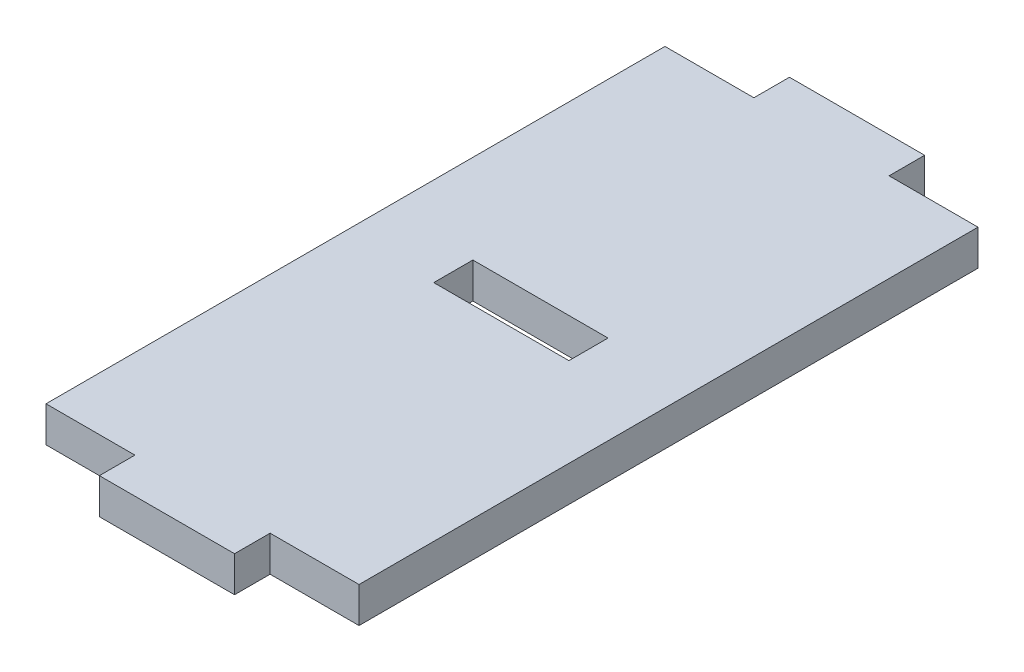
ISO-10303-21;
HEADER;
FILE_DESCRIPTION(('STEP AP214'),'2;1');
FILE_NAME('part.step','',(''),(''),'','','');
FILE_SCHEMA(('AUTOMOTIVE_DESIGN { 1 0 10303 214 1 1 1 1 }'));
ENDSEC;
DATA;
#1=APPLICATION_CONTEXT('core data for automotive mechanical design processes');
#2=APPLICATION_PROTOCOL_DEFINITION('international standard','automotive_design',2000,#1);
#3=PRODUCT_CONTEXT('',#1,'mechanical');
#4=PRODUCT('Part','Part','',(#3));
#5=PRODUCT_RELATED_PRODUCT_CATEGORY('part','',(#4));
#6=PRODUCT_DEFINITION_FORMATION('','',#4);
#7=PRODUCT_DEFINITION_CONTEXT('part definition',#1,'design');
#8=PRODUCT_DEFINITION('design','',#6,#7);
#9=PRODUCT_DEFINITION_SHAPE('','',#8);
#10=(LENGTH_UNIT() NAMED_UNIT(*) SI_UNIT(.MILLI.,.METRE.));
#11=(NAMED_UNIT(*) PLANE_ANGLE_UNIT() SI_UNIT($,.RADIAN.));
#12=(NAMED_UNIT(*) SI_UNIT($,.STERADIAN.) SOLID_ANGLE_UNIT());
#13=UNCERTAINTY_MEASURE_WITH_UNIT(LENGTH_MEASURE(1.E-05),#10,'distance_accuracy_value','');
#14=(GEOMETRIC_REPRESENTATION_CONTEXT(3) GLOBAL_UNCERTAINTY_ASSIGNED_CONTEXT((#13)) GLOBAL_UNIT_ASSIGNED_CONTEXT((#10,
#11,#12)) REPRESENTATION_CONTEXT('',''));
#15=CARTESIAN_POINT('',(0.,0.,0.));
#16=DIRECTION('',(0.,0.,1.));
#17=DIRECTION('',(1.,0.,0.));
#18=AXIS2_PLACEMENT_3D('',#15,#16,#17);
#19=CARTESIAN_POINT('',(0.,2.,-19.));
#20=DIRECTION('',(0.,0.,-1.));
#21=DIRECTION('',(-1.,0.,0.));
#22=AXIS2_PLACEMENT_3D('',#19,#20,#21);
#23=PLANE('',#22);
#24=DIRECTION('',(1.,0.,0.));
#25=VECTOR('',#24,1.);
#26=CARTESIAN_POINT('',(0.,0.,-19.));
#27=LINE('',#26,#25);
#28=CARTESIAN_POINT('',(5.,0.,-19.));
#29=VERTEX_POINT('',#28);
#30=CARTESIAN_POINT('',(12.6,0.,-19.));
#31=VERTEX_POINT('',#30);
#32=EDGE_CURVE('E212',#29,#31,#27,.T.);
#33=ORIENTED_EDGE('',*,*,#32,.T.);
#34=DIRECTION('',(0.,-1.,0.));
#35=VECTOR('',#34,1.);
#36=CARTESIAN_POINT('',(12.6,2.,-19.));
#37=LINE('',#36,#35);
#38=CARTESIAN_POINT('',(12.6,2.,-19.));
#39=VERTEX_POINT('',#38);
#40=EDGE_CURVE('E11',#39,#31,#37,.T.);
#41=ORIENTED_EDGE('',*,*,#40,.F.);
#42=DIRECTION('',(1.,0.,0.));
#43=VECTOR('',#42,1.);
#44=CARTESIAN_POINT('',(0.,2.,-19.));
#45=LINE('',#44,#43);
#46=CARTESIAN_POINT('',(5.,2.,-19.));
#47=VERTEX_POINT('',#46);
#48=EDGE_CURVE('E164',#47,#39,#45,.T.);
#49=ORIENTED_EDGE('',*,*,#48,.F.);
#50=DIRECTION('',(0.,-1.,0.));
#51=VECTOR('',#50,1.);
#52=CARTESIAN_POINT('',(5.,2.,-19.));
#53=LINE('',#52,#51);
#54=EDGE_CURVE('E55',#47,#29,#53,.T.);
#55=ORIENTED_EDGE('',*,*,#54,.T.);
#56=EDGE_LOOP('',(#33,#41,#49,#55));
#57=FACE_BOUND('',#56,.T.);
#58=ADVANCED_FACE('F36',(#57),#23,.F.);
#59=CARTESIAN_POINT('',(12.6,2.,0.));
#60=DIRECTION('',(1.,0.,0.));
#61=DIRECTION('',(0.,0.,-1.));
#62=AXIS2_PLACEMENT_3D('',#59,#60,#61);
#63=PLANE('',#62);
#64=DIRECTION('',(0.,0.,1.));
#65=VECTOR('',#64,1.);
#66=CARTESIAN_POINT('',(12.6,0.,0.));
#67=LINE('',#66,#65);
#68=CARTESIAN_POINT('',(12.6,0.,-16.8));
#69=VERTEX_POINT('',#68);
#70=EDGE_CURVE('E170',#31,#69,#67,.T.);
#71=ORIENTED_EDGE('',*,*,#70,.T.);
#72=DIRECTION('',(0.,-1.,0.));
#73=VECTOR('',#72,1.);
#74=CARTESIAN_POINT('',(12.6,2.,-16.8));
#75=LINE('',#74,#73);
#76=CARTESIAN_POINT('',(12.6,2.,-16.8));
#77=VERTEX_POINT('',#76);
#78=EDGE_CURVE('E46',#77,#69,#75,.T.);
#79=ORIENTED_EDGE('',*,*,#78,.F.);
#80=DIRECTION('',(0.,0.,1.));
#81=VECTOR('',#80,1.);
#82=CARTESIAN_POINT('',(12.6,2.,0.));
#83=LINE('',#82,#81);
#84=EDGE_CURVE('E158',#39,#77,#83,.T.);
#85=ORIENTED_EDGE('',*,*,#84,.F.);
#86=ORIENTED_EDGE('',*,*,#40,.T.);
#87=EDGE_LOOP('',(#71,#79,#85,#86));
#88=FACE_BOUND('',#87,.T.);
#89=ADVANCED_FACE('F169',(#88),#63,.F.);
#90=CARTESIAN_POINT('',(0.,2.,-16.8));
#91=DIRECTION('',(0.,0.,-1.));
#92=DIRECTION('',(-1.,0.,0.));
#93=AXIS2_PLACEMENT_3D('',#90,#91,#92);
#94=PLANE('',#93);
#95=DIRECTION('',(1.,0.,0.));
#96=VECTOR('',#95,1.);
#97=CARTESIAN_POINT('',(0.,0.,-16.8));
#98=LINE('',#97,#96);
#99=CARTESIAN_POINT('',(5.,0.,-16.8));
#100=VERTEX_POINT('',#99);
#101=EDGE_CURVE('E215',#100,#69,#98,.T.);
#102=ORIENTED_EDGE('',*,*,#101,.F.);
#103=DIRECTION('',(0.,-1.,0.));
#104=VECTOR('',#103,1.);
#105=CARTESIAN_POINT('',(5.,2.,-16.8));
#106=LINE('',#105,#104);
#107=CARTESIAN_POINT('',(5.,2.,-16.8));
#108=VERTEX_POINT('',#107);
#109=EDGE_CURVE('E105',#108,#100,#106,.T.);
#110=ORIENTED_EDGE('',*,*,#109,.F.);
#111=DIRECTION('',(1.,0.,0.));
#112=VECTOR('',#111,1.);
#113=CARTESIAN_POINT('',(0.,2.,-16.8));
#114=LINE('',#113,#112);
#115=EDGE_CURVE('E163',#108,#77,#114,.T.);
#116=ORIENTED_EDGE('',*,*,#115,.T.);
#117=ORIENTED_EDGE('',*,*,#78,.T.);
#118=EDGE_LOOP('',(#102,#110,#116,#117));
#119=FACE_BOUND('',#118,.T.);
#120=ADVANCED_FACE('F174',(#119),#94,.T.);
#121=CARTESIAN_POINT('',(0.,2.,0.));
#122=DIRECTION('',(0.,0.,-1.));
#123=DIRECTION('',(-1.,0.,0.));
#124=AXIS2_PLACEMENT_3D('',#121,#122,#123);
#125=PLANE('',#124);
#126=DIRECTION('',(1.,0.,0.));
#127=VECTOR('',#126,1.);
#128=CARTESIAN_POINT('',(0.,0.,0.));
#129=LINE('',#128,#127);
#130=CARTESIAN_POINT('',(0.,0.,0.));
#131=VERTEX_POINT('',#130);
#132=CARTESIAN_POINT('',(5.,0.,0.));
#133=VERTEX_POINT('',#132);
#134=EDGE_CURVE('E181',#131,#133,#129,.T.);
#135=ORIENTED_EDGE('',*,*,#134,.T.);
#136=DIRECTION('',(0.,-1.,0.));
#137=VECTOR('',#136,1.);
#138=CARTESIAN_POINT('',(5.,2.,0.));
#139=LINE('',#138,#137);
#140=CARTESIAN_POINT('',(5.,2.,0.));
#141=VERTEX_POINT('',#140);
#142=EDGE_CURVE('E40',#141,#133,#139,.T.);
#143=ORIENTED_EDGE('',*,*,#142,.F.);
#144=DIRECTION('',(1.,0.,0.));
#145=VECTOR('',#144,1.);
#146=CARTESIAN_POINT('',(0.,2.,0.));
#147=LINE('',#146,#145);
#148=CARTESIAN_POINT('',(0.,2.,0.));
#149=VERTEX_POINT('',#148);
#150=EDGE_CURVE('E220',#149,#141,#147,.T.);
#151=ORIENTED_EDGE('',*,*,#150,.F.);
#152=DIRECTION('',(0.,-1.,0.));
#153=VECTOR('',#152,1.);
#154=CARTESIAN_POINT('',(0.,2.,0.));
#155=LINE('',#154,#153);
#156=EDGE_CURVE('E177',#149,#131,#155,.T.);
#157=ORIENTED_EDGE('',*,*,#156,.T.);
#158=EDGE_LOOP('',(#135,#143,#151,#157));
#159=FACE_BOUND('',#158,.T.);
#160=ADVANCED_FACE('F251',(#159),#125,.F.);
#161=CARTESIAN_POINT('',(5.,2.,0.));
#162=DIRECTION('',(1.,0.,0.));
#163=DIRECTION('',(0.,0.,-1.));
#164=AXIS2_PLACEMENT_3D('',#161,#162,#163);
#165=PLANE('',#164);
#166=DIRECTION('',(0.,0.,1.));
#167=VECTOR('',#166,1.);
#168=CARTESIAN_POINT('',(5.,0.,0.));
#169=LINE('',#168,#167);
#170=CARTESIAN_POINT('',(5.,0.,2.));
#171=VERTEX_POINT('',#170);
#172=EDGE_CURVE('E184',#133,#171,#169,.T.);
#173=ORIENTED_EDGE('',*,*,#172,.T.);
#174=DIRECTION('',(0.,-1.,0.));
#175=VECTOR('',#174,1.);
#176=CARTESIAN_POINT('',(5.,2.,2.));
#177=LINE('',#176,#175);
#178=CARTESIAN_POINT('',(5.,2.,2.));
#179=VERTEX_POINT('',#178);
#180=EDGE_CURVE('E242',#179,#171,#177,.T.);
#181=ORIENTED_EDGE('',*,*,#180,.F.);
#182=DIRECTION('',(0.,0.,1.));
#183=VECTOR('',#182,1.);
#184=CARTESIAN_POINT('',(5.,2.,0.));
#185=LINE('',#184,#183);
#186=EDGE_CURVE('E118',#141,#179,#185,.T.);
#187=ORIENTED_EDGE('',*,*,#186,.F.);
#188=ORIENTED_EDGE('',*,*,#142,.T.);
#189=EDGE_LOOP('',(#173,#181,#187,#188));
#190=FACE_BOUND('',#189,.T.);
#191=ADVANCED_FACE('F38',(#190),#165,.F.);
#192=CARTESIAN_POINT('',(0.,2.,2.));
#193=DIRECTION('',(0.,0.,-1.));
#194=DIRECTION('',(-1.,0.,0.));
#195=AXIS2_PLACEMENT_3D('',#192,#193,#194);
#196=PLANE('',#195);
#197=DIRECTION('',(1.,0.,0.));
#198=VECTOR('',#197,1.);
#199=CARTESIAN_POINT('',(0.,0.,2.));
#200=LINE('',#199,#198);
#201=CARTESIAN_POINT('',(12.6,0.,2.));
#202=VERTEX_POINT('',#201);
#203=EDGE_CURVE('E187',#171,#202,#200,.T.);
#204=ORIENTED_EDGE('',*,*,#203,.T.);
#205=DIRECTION('',(0.,-1.,0.));
#206=VECTOR('',#205,1.);
#207=CARTESIAN_POINT('',(12.6,2.,2.));
#208=LINE('',#207,#206);
#209=CARTESIAN_POINT('',(12.6,2.,2.));
#210=VERTEX_POINT('',#209);
#211=EDGE_CURVE('E241',#210,#202,#208,.T.);
#212=ORIENTED_EDGE('',*,*,#211,.F.);
#213=DIRECTION('',(1.,0.,0.));
#214=VECTOR('',#213,1.);
#215=CARTESIAN_POINT('',(0.,2.,2.));
#216=LINE('',#215,#214);
#217=EDGE_CURVE('E355',#179,#210,#216,.T.);
#218=ORIENTED_EDGE('',*,*,#217,.F.);
#219=ORIENTED_EDGE('',*,*,#180,.T.);
#220=EDGE_LOOP('',(#204,#212,#218,#219));
#221=FACE_BOUND('',#220,.T.);
#222=ADVANCED_FACE('F307',(#221),#196,.F.);
#223=CARTESIAN_POINT('',(12.6,2.,0.));
#224=DIRECTION('',(1.,0.,0.));
#225=DIRECTION('',(0.,0.,-1.));
#226=AXIS2_PLACEMENT_3D('',#223,#224,#225);
#227=PLANE('',#226);
#228=DIRECTION('',(0.,0.,1.));
#229=VECTOR('',#228,1.);
#230=CARTESIAN_POINT('',(12.6,0.,0.));
#231=LINE('',#230,#229);
#232=CARTESIAN_POINT('',(12.6,0.,0.));
#233=VERTEX_POINT('',#232);
#234=EDGE_CURVE('E190',#233,#202,#231,.T.);
#235=ORIENTED_EDGE('',*,*,#234,.F.);
#236=DIRECTION('',(0.,-1.,0.));
#237=VECTOR('',#236,1.);
#238=CARTESIAN_POINT('',(12.6,2.,0.));
#239=LINE('',#238,#237);
#240=CARTESIAN_POINT('',(12.6,2.,0.));
#241=VERTEX_POINT('',#240);
#242=EDGE_CURVE('E239',#241,#233,#239,.T.);
#243=ORIENTED_EDGE('',*,*,#242,.F.);
#244=DIRECTION('',(0.,0.,1.));
#245=VECTOR('',#244,1.);
#246=CARTESIAN_POINT('',(12.6,2.,0.));
#247=LINE('',#246,#245);
#248=EDGE_CURVE('E306',#241,#210,#247,.T.);
#249=ORIENTED_EDGE('',*,*,#248,.T.);
#250=ORIENTED_EDGE('',*,*,#211,.T.);
#251=EDGE_LOOP('',(#235,#243,#249,#250));
#252=FACE_BOUND('',#251,.T.);
#253=ADVANCED_FACE('F303',(#252),#227,.T.);
#254=CARTESIAN_POINT('',(17.6,0.,0.));
#255=VERTEX_POINT('',#254);
#256=EDGE_CURVE('E185',#233,#255,#129,.T.);
#257=ORIENTED_EDGE('',*,*,#256,.T.);
#258=DIRECTION('',(0.,-1.,0.));
#259=VECTOR('',#258,1.);
#260=CARTESIAN_POINT('',(17.6,2.,0.));
#261=LINE('',#260,#259);
#262=CARTESIAN_POINT('',(17.6,2.,0.));
#263=VERTEX_POINT('',#262);
#264=EDGE_CURVE('E236',#263,#255,#261,.T.);
#265=ORIENTED_EDGE('',*,*,#264,.F.);
#266=EDGE_CURVE('E299',#241,#263,#147,.T.);
#267=ORIENTED_EDGE('',*,*,#266,.F.);
#268=ORIENTED_EDGE('',*,*,#242,.T.);
#269=EDGE_LOOP('',(#257,#265,#267,#268));
#270=FACE_BOUND('',#269,.T.);
#271=ADVANCED_FACE('F298',(#270),#125,.F.);
#272=CARTESIAN_POINT('',(17.6,2.,0.));
#273=DIRECTION('',(-1.,0.,0.));
#274=DIRECTION('',(0.,0.,1.));
#275=AXIS2_PLACEMENT_3D('',#272,#273,#274);
#276=PLANE('',#275);
#277=DIRECTION('',(0.,0.,-1.));
#278=VECTOR('',#277,1.);
#279=CARTESIAN_POINT('',(17.6,0.,0.));
#280=LINE('',#279,#278);
#281=CARTESIAN_POINT('',(17.6,0.,-34.8));
#282=VERTEX_POINT('',#281);
#283=EDGE_CURVE('E193',#255,#282,#280,.T.);
#284=ORIENTED_EDGE('',*,*,#283,.T.);
#285=DIRECTION('',(0.,-1.,0.));
#286=VECTOR('',#285,1.);
#287=CARTESIAN_POINT('',(17.6,2.,-34.8));
#288=LINE('',#287,#286);
#289=CARTESIAN_POINT('',(17.6,2.,-34.8));
#290=VERTEX_POINT('',#289);
#291=EDGE_CURVE('E234',#290,#282,#288,.T.);
#292=ORIENTED_EDGE('',*,*,#291,.F.);
#293=DIRECTION('',(0.,0.,-1.));
#294=VECTOR('',#293,1.);
#295=CARTESIAN_POINT('',(17.6,2.,0.));
#296=LINE('',#295,#294);
#297=EDGE_CURVE('E295',#263,#290,#296,.T.);
#298=ORIENTED_EDGE('',*,*,#297,.F.);
#299=ORIENTED_EDGE('',*,*,#264,.T.);
#300=EDGE_LOOP('',(#284,#292,#298,#299));
#301=FACE_BOUND('',#300,.T.);
#302=ADVANCED_FACE('F293',(#301),#276,.F.);
#303=CARTESIAN_POINT('',(0.,2.,-34.8));
#304=DIRECTION('',(0.,0.,-1.));
#305=DIRECTION('',(-1.,0.,0.));
#306=AXIS2_PLACEMENT_3D('',#303,#304,#305);
#307=PLANE('',#306);
#308=DIRECTION('',(1.,0.,0.));
#309=VECTOR('',#308,1.);
#310=CARTESIAN_POINT('',(0.,0.,-34.8));
#311=LINE('',#310,#309);
#312=CARTESIAN_POINT('',(12.6,0.,-34.8));
#313=VERTEX_POINT('',#312);
#314=EDGE_CURVE('E196',#313,#282,#311,.T.);
#315=ORIENTED_EDGE('',*,*,#314,.F.);
#316=DIRECTION('',(0.,-1.,0.));
#317=VECTOR('',#316,1.);
#318=CARTESIAN_POINT('',(12.6,2.,-34.8));
#319=LINE('',#318,#317);
#320=CARTESIAN_POINT('',(12.6,2.,-34.8));
#321=VERTEX_POINT('',#320);
#322=EDGE_CURVE('E232',#321,#313,#319,.T.);
#323=ORIENTED_EDGE('',*,*,#322,.F.);
#324=DIRECTION('',(1.,0.,0.));
#325=VECTOR('',#324,1.);
#326=CARTESIAN_POINT('',(0.,2.,-34.8));
#327=LINE('',#326,#325);
#328=EDGE_CURVE('E290',#321,#290,#327,.T.);
#329=ORIENTED_EDGE('',*,*,#328,.T.);
#330=ORIENTED_EDGE('',*,*,#291,.T.);
#331=EDGE_LOOP('',(#315,#323,#329,#330));
#332=FACE_BOUND('',#331,.T.);
#333=ADVANCED_FACE('F286',(#332),#307,.T.);
#334=CARTESIAN_POINT('',(12.6,2.,0.));
#335=DIRECTION('',(1.,0.,0.));
#336=DIRECTION('',(0.,0.,-1.));
#337=AXIS2_PLACEMENT_3D('',#334,#335,#336);
#338=PLANE('',#337);
#339=DIRECTION('',(0.,0.,1.));
#340=VECTOR('',#339,1.);
#341=CARTESIAN_POINT('',(12.6,0.,0.));
#342=LINE('',#341,#340);
#343=CARTESIAN_POINT('',(12.6,0.,-36.8));
#344=VERTEX_POINT('',#343);
#345=EDGE_CURVE('E199',#344,#313,#342,.T.);
#346=ORIENTED_EDGE('',*,*,#345,.F.);
#347=DIRECTION('',(0.,-1.,0.));
#348=VECTOR('',#347,1.);
#349=CARTESIAN_POINT('',(12.6,2.,-36.8));
#350=LINE('',#349,#348);
#351=CARTESIAN_POINT('',(12.6,2.,-36.8));
#352=VERTEX_POINT('',#351);
#353=EDGE_CURVE('E230',#352,#344,#350,.T.);
#354=ORIENTED_EDGE('',*,*,#353,.F.);
#355=DIRECTION('',(0.,0.,1.));
#356=VECTOR('',#355,1.);
#357=CARTESIAN_POINT('',(12.6,2.,0.));
#358=LINE('',#357,#356);
#359=EDGE_CURVE('E362',#352,#321,#358,.T.);
#360=ORIENTED_EDGE('',*,*,#359,.T.);
#361=ORIENTED_EDGE('',*,*,#322,.T.);
#362=EDGE_LOOP('',(#346,#354,#360,#361));
#363=FACE_BOUND('',#362,.T.);
#364=ADVANCED_FACE('F281',(#363),#338,.T.);
#365=CARTESIAN_POINT('',(0.,2.,-36.8));
#366=DIRECTION('',(0.,0.,-1.));
#367=DIRECTION('',(-1.,0.,0.));
#368=AXIS2_PLACEMENT_3D('',#365,#366,#367);
#369=PLANE('',#368);
#370=DIRECTION('',(1.,0.,0.));
#371=VECTOR('',#370,1.);
#372=CARTESIAN_POINT('',(0.,0.,-36.8));
#373=LINE('',#372,#371);
#374=CARTESIAN_POINT('',(5.,0.,-36.8));
#375=VERTEX_POINT('',#374);
#376=EDGE_CURVE('E203',#375,#344,#373,.T.);
#377=ORIENTED_EDGE('',*,*,#376,.F.);
#378=DIRECTION('',(0.,-1.,0.));
#379=VECTOR('',#378,1.);
#380=CARTESIAN_POINT('',(5.,2.,-36.8));
#381=LINE('',#380,#379);
#382=CARTESIAN_POINT('',(5.,2.,-36.8));
#383=VERTEX_POINT('',#382);
#384=EDGE_CURVE('E228',#383,#375,#381,.T.);
#385=ORIENTED_EDGE('',*,*,#384,.F.);
#386=DIRECTION('',(1.,0.,0.));
#387=VECTOR('',#386,1.);
#388=CARTESIAN_POINT('',(0.,2.,-36.8));
#389=LINE('',#388,#387);
#390=EDGE_CURVE('E277',#383,#352,#389,.T.);
#391=ORIENTED_EDGE('',*,*,#390,.T.);
#392=ORIENTED_EDGE('',*,*,#353,.T.);
#393=EDGE_LOOP('',(#377,#385,#391,#392));
#394=FACE_BOUND('',#393,.T.);
#395=ADVANCED_FACE('F272',(#394),#369,.T.);
#396=CARTESIAN_POINT('',(5.,2.,0.));
#397=DIRECTION('',(1.,0.,0.));
#398=DIRECTION('',(0.,0.,-1.));
#399=AXIS2_PLACEMENT_3D('',#396,#397,#398);
#400=PLANE('',#399);
#401=DIRECTION('',(0.,0.,1.));
#402=VECTOR('',#401,1.);
#403=CARTESIAN_POINT('',(5.,0.,0.));
#404=LINE('',#403,#402);
#405=CARTESIAN_POINT('',(5.,0.,-34.8));
#406=VERTEX_POINT('',#405);
#407=EDGE_CURVE('E206',#375,#406,#404,.T.);
#408=ORIENTED_EDGE('',*,*,#407,.T.);
#409=DIRECTION('',(0.,-1.,0.));
#410=VECTOR('',#409,1.);
#411=CARTESIAN_POINT('',(5.,2.,-34.8));
#412=LINE('',#411,#410);
#413=CARTESIAN_POINT('',(5.,2.,-34.8));
#414=VERTEX_POINT('',#413);
#415=EDGE_CURVE('E226',#414,#406,#412,.T.);
#416=ORIENTED_EDGE('',*,*,#415,.F.);
#417=DIRECTION('',(0.,0.,1.));
#418=VECTOR('',#417,1.);
#419=CARTESIAN_POINT('',(5.,2.,0.));
#420=LINE('',#419,#418);
#421=EDGE_CURVE('E366',#383,#414,#420,.T.);
#422=ORIENTED_EDGE('',*,*,#421,.F.);
#423=ORIENTED_EDGE('',*,*,#384,.T.);
#424=EDGE_LOOP('',(#408,#416,#422,#423));
#425=FACE_BOUND('',#424,.T.);
#426=ADVANCED_FACE('F327',(#425),#400,.F.);
#427=CARTESIAN_POINT('',(0.,0.,-34.8));
#428=VERTEX_POINT('',#427);
#429=EDGE_CURVE('E200',#428,#406,#311,.T.);
#430=ORIENTED_EDGE('',*,*,#429,.F.);
#431=DIRECTION('',(0.,-1.,0.));
#432=VECTOR('',#431,1.);
#433=CARTESIAN_POINT('',(0.,2.,-34.8));
#434=LINE('',#433,#432);
#435=CARTESIAN_POINT('',(0.,2.,-34.8));
#436=VERTEX_POINT('',#435);
#437=EDGE_CURVE('E224',#436,#428,#434,.T.);
#438=ORIENTED_EDGE('',*,*,#437,.F.);
#439=EDGE_CURVE('E363',#436,#414,#327,.T.);
#440=ORIENTED_EDGE('',*,*,#439,.T.);
#441=ORIENTED_EDGE('',*,*,#415,.T.);
#442=EDGE_LOOP('',(#430,#438,#440,#441));
#443=FACE_BOUND('',#442,.T.);
#444=ADVANCED_FACE('F266',(#443),#307,.T.);
#445=CARTESIAN_POINT('',(0.,2.,0.));
#446=DIRECTION('',(-1.,0.,0.));
#447=DIRECTION('',(0.,0.,1.));
#448=AXIS2_PLACEMENT_3D('',#445,#446,#447);
#449=PLANE('',#448);
#450=DIRECTION('',(0.,0.,-1.));
#451=VECTOR('',#450,1.);
#452=CARTESIAN_POINT('',(0.,0.,0.));
#453=LINE('',#452,#451);
#454=EDGE_CURVE('E209',#131,#428,#453,.T.);
#455=ORIENTED_EDGE('',*,*,#454,.F.);
#456=ORIENTED_EDGE('',*,*,#156,.F.);
#457=DIRECTION('',(0.,0.,-1.));
#458=VECTOR('',#457,1.);
#459=CARTESIAN_POINT('',(0.,2.,0.));
#460=LINE('',#459,#458);
#461=EDGE_CURVE('E262',#149,#436,#460,.T.);
#462=ORIENTED_EDGE('',*,*,#461,.T.);
#463=ORIENTED_EDGE('',*,*,#437,.T.);
#464=EDGE_LOOP('',(#455,#456,#462,#463));
#465=FACE_BOUND('',#464,.T.);
#466=ADVANCED_FACE('F258',(#465),#449,.T.);
#467=CARTESIAN_POINT('',(5.,2.,0.));
#468=DIRECTION('',(1.,0.,0.));
#469=DIRECTION('',(0.,0.,-1.));
#470=AXIS2_PLACEMENT_3D('',#467,#468,#469);
#471=PLANE('',#470);
#472=DIRECTION('',(0.,0.,1.));
#473=VECTOR('',#472,1.);
#474=CARTESIAN_POINT('',(5.,0.,0.));
#475=LINE('',#474,#473);
#476=EDGE_CURVE('E217',#29,#100,#475,.T.);
#477=ORIENTED_EDGE('',*,*,#476,.F.);
#478=ORIENTED_EDGE('',*,*,#54,.F.);
#479=DIRECTION('',(0.,0.,1.));
#480=VECTOR('',#479,1.);
#481=CARTESIAN_POINT('',(5.,2.,0.));
#482=LINE('',#481,#480);
#483=EDGE_CURVE('E175',#47,#108,#482,.T.);
#484=ORIENTED_EDGE('',*,*,#483,.T.);
#485=ORIENTED_EDGE('',*,*,#109,.T.);
#486=EDGE_LOOP('',(#477,#478,#484,#485));
#487=FACE_BOUND('',#486,.T.);
#488=ADVANCED_FACE('F324',(#487),#471,.T.);
#489=CARTESIAN_POINT('',(0.,2.,0.));
#490=DIRECTION('',(0.,1.,0.));
#491=DIRECTION('',(0.,0.,1.));
#492=AXIS2_PLACEMENT_3D('',#489,#490,#491);
#493=PLANE('',#492);
#494=ORIENTED_EDGE('',*,*,#150,.T.);
#495=ORIENTED_EDGE('',*,*,#186,.T.);
#496=ORIENTED_EDGE('',*,*,#217,.T.);
#497=ORIENTED_EDGE('',*,*,#248,.F.);
#498=ORIENTED_EDGE('',*,*,#266,.T.);
#499=ORIENTED_EDGE('',*,*,#297,.T.);
#500=ORIENTED_EDGE('',*,*,#328,.F.);
#501=ORIENTED_EDGE('',*,*,#359,.F.);
#502=ORIENTED_EDGE('',*,*,#390,.F.);
#503=ORIENTED_EDGE('',*,*,#421,.T.);
#504=ORIENTED_EDGE('',*,*,#439,.F.);
#505=ORIENTED_EDGE('',*,*,#461,.F.);
#506=EDGE_LOOP('',(#494,#495,#496,#497,#498,#499,#500,#501,#502,#503,#504,#505));
#507=FACE_BOUND('',#506,.T.);
#508=ORIENTED_EDGE('',*,*,#48,.T.);
#509=ORIENTED_EDGE('',*,*,#84,.T.);
#510=ORIENTED_EDGE('',*,*,#115,.F.);
#511=ORIENTED_EDGE('',*,*,#483,.F.);
#512=EDGE_LOOP('',(#508,#509,#510,#511));
#513=FACE_BOUND('',#512,.T.);
#514=ADVANCED_FACE('F160',(#507,#513),#493,.T.);
#515=CARTESIAN_POINT('',(0.,0.,0.));
#516=DIRECTION('',(0.,1.,0.));
#517=DIRECTION('',(0.,0.,1.));
#518=AXIS2_PLACEMENT_3D('',#515,#516,#517);
#519=PLANE('',#518);
#520=ORIENTED_EDGE('',*,*,#134,.F.);
#521=ORIENTED_EDGE('',*,*,#454,.T.);
#522=ORIENTED_EDGE('',*,*,#429,.T.);
#523=ORIENTED_EDGE('',*,*,#407,.F.);
#524=ORIENTED_EDGE('',*,*,#376,.T.);
#525=ORIENTED_EDGE('',*,*,#345,.T.);
#526=ORIENTED_EDGE('',*,*,#314,.T.);
#527=ORIENTED_EDGE('',*,*,#283,.F.);
#528=ORIENTED_EDGE('',*,*,#256,.F.);
#529=ORIENTED_EDGE('',*,*,#234,.T.);
#530=ORIENTED_EDGE('',*,*,#203,.F.);
#531=ORIENTED_EDGE('',*,*,#172,.F.);
#532=EDGE_LOOP('',(#520,#521,#522,#523,#524,#525,#526,#527,#528,#529,#530,#531));
#533=FACE_BOUND('',#532,.T.);
#534=ORIENTED_EDGE('',*,*,#32,.F.);
#535=ORIENTED_EDGE('',*,*,#476,.T.);
#536=ORIENTED_EDGE('',*,*,#101,.T.);
#537=ORIENTED_EDGE('',*,*,#70,.F.);
#538=EDGE_LOOP('',(#534,#535,#536,#537));
#539=FACE_BOUND('',#538,.T.);
#540=ADVANCED_FACE('F254',(#533,#539),#519,.F.);
#541=CLOSED_SHELL('',(#58,#89,#120,#160,#191,#222,#253,#271,#302,#333,#364,#395,#426,#444,#466,
#488,#514,#540));
#542=MANIFOLD_SOLID_BREP('B2',#541);
#543=ADVANCED_BREP_SHAPE_REPRESENTATION('',(#18,#542),#14);
#544=SHAPE_DEFINITION_REPRESENTATION(#9,#543);
ENDSEC;
END-ISO-10303-21;
